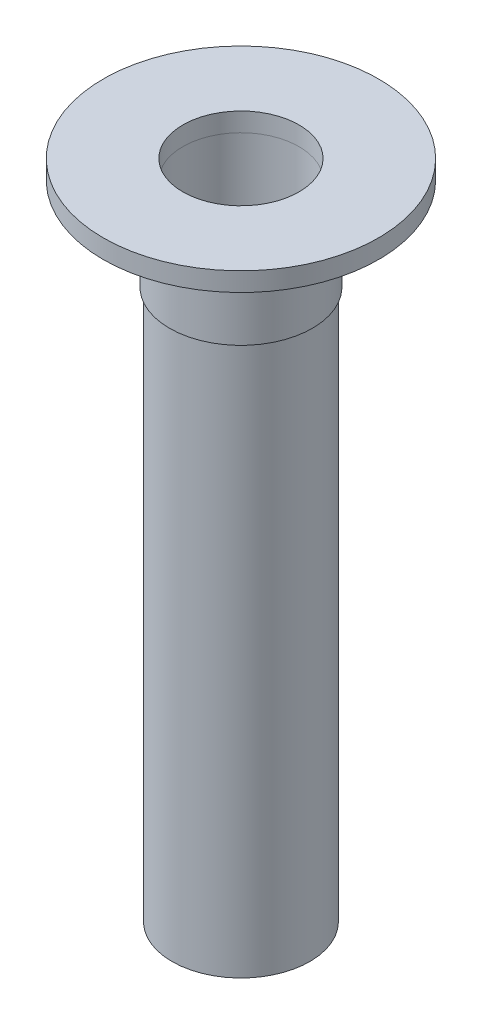
ISO-10303-21;
HEADER;
FILE_DESCRIPTION(('STEP AP214'),'2;1');
FILE_NAME('part.step','',(''),(''),'','','');
FILE_SCHEMA(('AUTOMOTIVE_DESIGN { 1 0 10303 214 1 1 1 1 }'));
ENDSEC;
DATA;
#1=APPLICATION_CONTEXT('core data for automotive mechanical design processes');
#2=APPLICATION_PROTOCOL_DEFINITION('international standard','automotive_design',2000,#1);
#3=PRODUCT_CONTEXT('',#1,'mechanical');
#4=PRODUCT('Part','Part','',(#3));
#5=PRODUCT_RELATED_PRODUCT_CATEGORY('part','',(#4));
#6=PRODUCT_DEFINITION_FORMATION('','',#4);
#7=PRODUCT_DEFINITION_CONTEXT('part definition',#1,'design');
#8=PRODUCT_DEFINITION('design','',#6,#7);
#9=PRODUCT_DEFINITION_SHAPE('','',#8);
#10=(LENGTH_UNIT() NAMED_UNIT(*) SI_UNIT(.MILLI.,.METRE.));
#11=(NAMED_UNIT(*) PLANE_ANGLE_UNIT() SI_UNIT($,.RADIAN.));
#12=(NAMED_UNIT(*) SI_UNIT($,.STERADIAN.) SOLID_ANGLE_UNIT());
#13=UNCERTAINTY_MEASURE_WITH_UNIT(LENGTH_MEASURE(1.E-05),#10,'distance_accuracy_value','');
#14=(GEOMETRIC_REPRESENTATION_CONTEXT(3) GLOBAL_UNCERTAINTY_ASSIGNED_CONTEXT((#13)) GLOBAL_UNIT_ASSIGNED_CONTEXT((#10,
#11,#12)) REPRESENTATION_CONTEXT('',''));
#15=CARTESIAN_POINT('',(0.,0.,0.));
#16=DIRECTION('',(0.,0.,1.));
#17=DIRECTION('',(1.,0.,0.));
#18=AXIS2_PLACEMENT_3D('',#15,#16,#17);
#19=CARTESIAN_POINT('',(0.,20.7228846153846,0.));
#20=DIRECTION('',(0.,1.,0.));
#21=DIRECTION('',(0.,0.,1.));
#22=AXIS2_PLACEMENT_3D('',#19,#20,#21);
#23=PLANE('',#22);
#24=CARTESIAN_POINT('',(0.,20.7228846153846,0.));
#25=DIRECTION('',(0.,1.,0.));
#26=DIRECTION('',(0.,0.,1.));
#27=AXIS2_PLACEMENT_3D('',#24,#25,#26);
#28=CIRCLE('',#27,5.77);
#29=CARTESIAN_POINT('',(0.,20.7228846153846,5.77));
#30=VERTEX_POINT('',#29);
#31=EDGE_CURVE('E56',#30,#30,#28,.T.);
#32=ORIENTED_EDGE('',*,*,#31,.F.);
#33=EDGE_LOOP('',(#32));
#34=FACE_BOUND('',#33,.T.);
#35=CARTESIAN_POINT('',(0.,20.7228846153846,0.));
#36=DIRECTION('',(0.,1.,0.));
#37=DIRECTION('',(0.,0.,1.));
#38=AXIS2_PLACEMENT_3D('',#35,#36,#37);
#39=CIRCLE('',#38,13.675);
#40=CARTESIAN_POINT('',(0.,20.7228846153846,13.675));
#41=VERTEX_POINT('',#40);
#42=EDGE_CURVE('E10',#41,#41,#39,.T.);
#43=ORIENTED_EDGE('',*,*,#42,.T.);
#44=EDGE_LOOP('',(#43));
#45=FACE_BOUND('',#44,.T.);
#46=ADVANCED_FACE('F31',(#34,#45),#23,.T.);
#47=CARTESIAN_POINT('',(0.,20.7228846153846,0.));
#48=DIRECTION('',(0.,1.,0.));
#49=DIRECTION('',(0.,0.,1.));
#50=AXIS2_PLACEMENT_3D('',#47,#48,#49);
#51=CYLINDRICAL_SURFACE('',#50,13.675);
#52=CARTESIAN_POINT('',(0.,18.8528846153846,0.));
#53=DIRECTION('',(0.,1.,0.));
#54=DIRECTION('',(0.,0.,1.));
#55=AXIS2_PLACEMENT_3D('',#52,#53,#54);
#56=CIRCLE('',#55,13.675);
#57=CARTESIAN_POINT('',(0.,18.8528846153846,13.675));
#58=VERTEX_POINT('',#57);
#59=EDGE_CURVE('E37',#58,#58,#56,.T.);
#60=ORIENTED_EDGE('',*,*,#59,.T.);
#61=EDGE_LOOP('',(#60));
#62=FACE_BOUND('',#61,.T.);
#63=ORIENTED_EDGE('',*,*,#42,.F.);
#64=EDGE_LOOP('',(#63));
#65=FACE_BOUND('',#64,.T.);
#66=ADVANCED_FACE('F109',(#62,#65),#51,.T.);
#67=CARTESIAN_POINT('',(-13.675,18.8528846153846,0.));
#68=DIRECTION('',(0.,-1.,0.));
#69=DIRECTION('',(0.,0.,-1.));
#70=AXIS2_PLACEMENT_3D('',#67,#68,#69);
#71=PLANE('',#70);
#72=CARTESIAN_POINT('',(0.,18.8528846153846,0.));
#73=DIRECTION('',(0.,1.,0.));
#74=DIRECTION('',(0.,0.,1.));
#75=AXIS2_PLACEMENT_3D('',#72,#73,#74);
#76=CIRCLE('',#75,7.095);
#77=CARTESIAN_POINT('',(0.,18.8528846153846,7.095));
#78=VERTEX_POINT('',#77);
#79=EDGE_CURVE('E41',#78,#78,#76,.T.);
#80=ORIENTED_EDGE('',*,*,#79,.T.);
#81=EDGE_LOOP('',(#80));
#82=FACE_BOUND('',#81,.T.);
#83=ORIENTED_EDGE('',*,*,#59,.F.);
#84=EDGE_LOOP('',(#83));
#85=FACE_BOUND('',#84,.T.);
#86=ADVANCED_FACE('F113',(#82,#85),#71,.T.);
#87=CARTESIAN_POINT('',(0.,20.7228846153846,0.));
#88=DIRECTION('',(0.,1.,0.));
#89=DIRECTION('',(0.,0.,1.));
#90=AXIS2_PLACEMENT_3D('',#87,#88,#89);
#91=CYLINDRICAL_SURFACE('',#90,7.095);
#92=CARTESIAN_POINT('',(0.,9.65288461538463,0.));
#93=DIRECTION('',(0.,1.,0.));
#94=DIRECTION('',(0.,0.,1.));
#95=AXIS2_PLACEMENT_3D('',#92,#93,#94);
#96=CIRCLE('',#95,7.095);
#97=CARTESIAN_POINT('',(0.,9.65288461538463,7.095));
#98=VERTEX_POINT('',#97);
#99=EDGE_CURVE('E45',#98,#98,#96,.T.);
#100=ORIENTED_EDGE('',*,*,#99,.T.);
#101=EDGE_LOOP('',(#100));
#102=FACE_BOUND('',#101,.T.);
#103=ORIENTED_EDGE('',*,*,#79,.F.);
#104=EDGE_LOOP('',(#103));
#105=FACE_BOUND('',#104,.T.);
#106=ADVANCED_FACE('F117',(#102,#105),#91,.T.);
#107=CARTESIAN_POINT('',(-7.095,9.65288461538463,0.));
#108=DIRECTION('',(0.,-1.,0.));
#109=DIRECTION('',(0.,0.,-1.));
#110=AXIS2_PLACEMENT_3D('',#107,#108,#109);
#111=PLANE('',#110);
#112=CARTESIAN_POINT('',(0.,9.65288461538463,0.));
#113=DIRECTION('',(0.,1.,0.));
#114=DIRECTION('',(0.,0.,1.));
#115=AXIS2_PLACEMENT_3D('',#112,#113,#114);
#116=CIRCLE('',#115,6.845);
#117=CARTESIAN_POINT('',(0.,9.65288461538463,6.845));
#118=VERTEX_POINT('',#117);
#119=EDGE_CURVE('E50',#118,#118,#116,.T.);
#120=ORIENTED_EDGE('',*,*,#119,.T.);
#121=EDGE_LOOP('',(#120));
#122=FACE_BOUND('',#121,.T.);
#123=ORIENTED_EDGE('',*,*,#99,.F.);
#124=EDGE_LOOP('',(#123));
#125=FACE_BOUND('',#124,.T.);
#126=ADVANCED_FACE('F124',(#122,#125),#111,.T.);
#127=CARTESIAN_POINT('',(0.,20.7228846153846,0.));
#128=DIRECTION('',(0.,1.,0.));
#129=DIRECTION('',(0.,0.,1.));
#130=AXIS2_PLACEMENT_3D('',#127,#128,#129);
#131=CYLINDRICAL_SURFACE('',#130,6.845);
#132=CARTESIAN_POINT('',(0.,-44.9471153846154,0.));
#133=DIRECTION('',(0.,1.,0.));
#134=DIRECTION('',(0.,0.,1.));
#135=AXIS2_PLACEMENT_3D('',#132,#133,#134);
#136=CIRCLE('',#135,6.84499999999999);
#137=CARTESIAN_POINT('',(0.,-44.9471153846154,6.84499999999999));
#138=VERTEX_POINT('',#137);
#139=EDGE_CURVE('E53',#138,#138,#136,.T.);
#140=ORIENTED_EDGE('',*,*,#139,.T.);
#141=EDGE_LOOP('',(#140));
#142=FACE_BOUND('',#141,.T.);
#143=ORIENTED_EDGE('',*,*,#119,.F.);
#144=EDGE_LOOP('',(#143));
#145=FACE_BOUND('',#144,.T.);
#146=ADVANCED_FACE('F128',(#142,#145),#131,.T.);
#147=CARTESIAN_POINT('',(-6.84499999999999,-44.9471153846154,0.));
#148=DIRECTION('',(0.,-1.,0.));
#149=DIRECTION('',(0.,0.,-1.));
#150=AXIS2_PLACEMENT_3D('',#147,#148,#149);
#151=PLANE('',#150);
#152=CARTESIAN_POINT('',(0.,-44.9471153846154,0.));
#153=DIRECTION('',(0.,1.,0.));
#154=DIRECTION('',(0.,0.,1.));
#155=AXIS2_PLACEMENT_3D('',#152,#153,#154);
#156=CIRCLE('',#155,5.675);
#157=CARTESIAN_POINT('',(0.,-44.9471153846154,5.675));
#158=VERTEX_POINT('',#157);
#159=EDGE_CURVE('E66',#158,#158,#156,.T.);
#160=ORIENTED_EDGE('',*,*,#159,.T.);
#161=EDGE_LOOP('',(#160));
#162=FACE_BOUND('',#161,.T.);
#163=ORIENTED_EDGE('',*,*,#139,.F.);
#164=EDGE_LOOP('',(#163));
#165=FACE_BOUND('',#164,.T.);
#166=ADVANCED_FACE('F75',(#162,#165),#151,.T.);
#167=CARTESIAN_POINT('',(0.,18.8528846153846,0.));
#168=DIRECTION('',(0.,1.,0.));
#169=DIRECTION('',(0.,0.,1.));
#170=AXIS2_PLACEMENT_3D('',#167,#168,#169);
#171=CYLINDRICAL_SURFACE('',#170,5.77);
#172=CARTESIAN_POINT('',(0.,18.8528846153846,0.));
#173=DIRECTION('',(0.,1.,0.));
#174=DIRECTION('',(0.,0.,1.));
#175=AXIS2_PLACEMENT_3D('',#172,#173,#174);
#176=CIRCLE('',#175,5.77);
#177=CARTESIAN_POINT('',(0.,18.8528846153846,5.77));
#178=VERTEX_POINT('',#177);
#179=EDGE_CURVE('E59',#178,#178,#176,.F.);
#180=ORIENTED_EDGE('',*,*,#179,.T.);
#181=EDGE_LOOP('',(#180));
#182=FACE_BOUND('',#181,.T.);
#183=ORIENTED_EDGE('',*,*,#31,.T.);
#184=EDGE_LOOP('',(#183));
#185=FACE_BOUND('',#184,.T.);
#186=ADVANCED_FACE('F99',(#182,#185),#171,.F.);
#187=CARTESIAN_POINT('',(0.,18.8528846153846,0.));
#188=DIRECTION('',(0.,1.,0.));
#189=DIRECTION('',(0.,0.,1.));
#190=AXIS2_PLACEMENT_3D('',#187,#188,#189);
#191=PLANE('',#190);
#192=CARTESIAN_POINT('',(0.,18.8528846153846,0.));
#193=DIRECTION('',(0.,1.,0.));
#194=DIRECTION('',(0.,0.,1.));
#195=AXIS2_PLACEMENT_3D('',#192,#193,#194);
#196=CIRCLE('',#195,5.785);
#197=CARTESIAN_POINT('',(0.,18.8528846153846,5.785));
#198=VERTEX_POINT('',#197);
#199=EDGE_CURVE('E63',#198,#198,#196,.T.);
#200=ORIENTED_EDGE('',*,*,#199,.F.);
#201=EDGE_LOOP('',(#200));
#202=FACE_BOUND('',#201,.T.);
#203=ORIENTED_EDGE('',*,*,#179,.F.);
#204=EDGE_LOOP('',(#203));
#205=FACE_BOUND('',#204,.T.);
#206=ADVANCED_FACE('F93',(#202,#205),#191,.F.);
#207=CARTESIAN_POINT('',(0.,9.65288461538463,0.));
#208=DIRECTION('',(0.,1.,0.));
#209=DIRECTION('',(0.,0.,1.));
#210=AXIS2_PLACEMENT_3D('',#207,#208,#209);
#211=CYLINDRICAL_SURFACE('',#210,5.785);
#212=CARTESIAN_POINT('',(0.,9.65288461538463,0.));
#213=DIRECTION('',(0.,1.,0.));
#214=DIRECTION('',(0.,0.,1.));
#215=AXIS2_PLACEMENT_3D('',#212,#213,#214);
#216=CIRCLE('',#215,5.785);
#217=CARTESIAN_POINT('',(0.,9.65288461538463,5.785));
#218=VERTEX_POINT('',#217);
#219=EDGE_CURVE('E62',#218,#218,#216,.T.);
#220=ORIENTED_EDGE('',*,*,#219,.F.);
#221=EDGE_LOOP('',(#220));
#222=FACE_BOUND('',#221,.T.);
#223=ORIENTED_EDGE('',*,*,#199,.T.);
#224=EDGE_LOOP('',(#223));
#225=FACE_BOUND('',#224,.T.);
#226=ADVANCED_FACE('F87',(#222,#225),#211,.F.);
#227=CARTESIAN_POINT('',(0.,9.65288461538463,0.));
#228=DIRECTION('',(0.,1.,0.));
#229=DIRECTION('',(0.,0.,1.));
#230=AXIS2_PLACEMENT_3D('',#227,#228,#229);
#231=PLANE('',#230);
#232=CARTESIAN_POINT('',(0.,9.65288461538463,0.));
#233=DIRECTION('',(0.,1.,0.));
#234=DIRECTION('',(0.,0.,1.));
#235=AXIS2_PLACEMENT_3D('',#232,#233,#234);
#236=CIRCLE('',#235,5.675);
#237=CARTESIAN_POINT('',(0.,9.65288461538463,5.675));
#238=VERTEX_POINT('',#237);
#239=EDGE_CURVE('E69',#238,#238,#236,.T.);
#240=ORIENTED_EDGE('',*,*,#239,.F.);
#241=EDGE_LOOP('',(#240));
#242=FACE_BOUND('',#241,.T.);
#243=ORIENTED_EDGE('',*,*,#219,.T.);
#244=EDGE_LOOP('',(#243));
#245=FACE_BOUND('',#244,.T.);
#246=ADVANCED_FACE('F81',(#242,#245),#231,.T.);
#247=CARTESIAN_POINT('',(0.,-44.9471153846154,0.));
#248=DIRECTION('',(0.,1.,0.));
#249=DIRECTION('',(0.,0.,1.));
#250=AXIS2_PLACEMENT_3D('',#247,#248,#249);
#251=CYLINDRICAL_SURFACE('',#250,5.675);
#252=ORIENTED_EDGE('',*,*,#159,.F.);
#253=EDGE_LOOP('',(#252));
#254=FACE_BOUND('',#253,.T.);
#255=ORIENTED_EDGE('',*,*,#239,.T.);
#256=EDGE_LOOP('',(#255));
#257=FACE_BOUND('',#256,.T.);
#258=ADVANCED_FACE('F78',(#254,#257),#251,.F.);
#259=CLOSED_SHELL('',(#46,#66,#86,#106,#126,#146,#166,#186,#206,#226,#246,#258));
#260=MANIFOLD_SOLID_BREP('B2',#259);
#261=ADVANCED_BREP_SHAPE_REPRESENTATION('',(#18,#260),#14);
#262=SHAPE_DEFINITION_REPRESENTATION(#9,#261);
ENDSEC;
END-ISO-10303-21;
